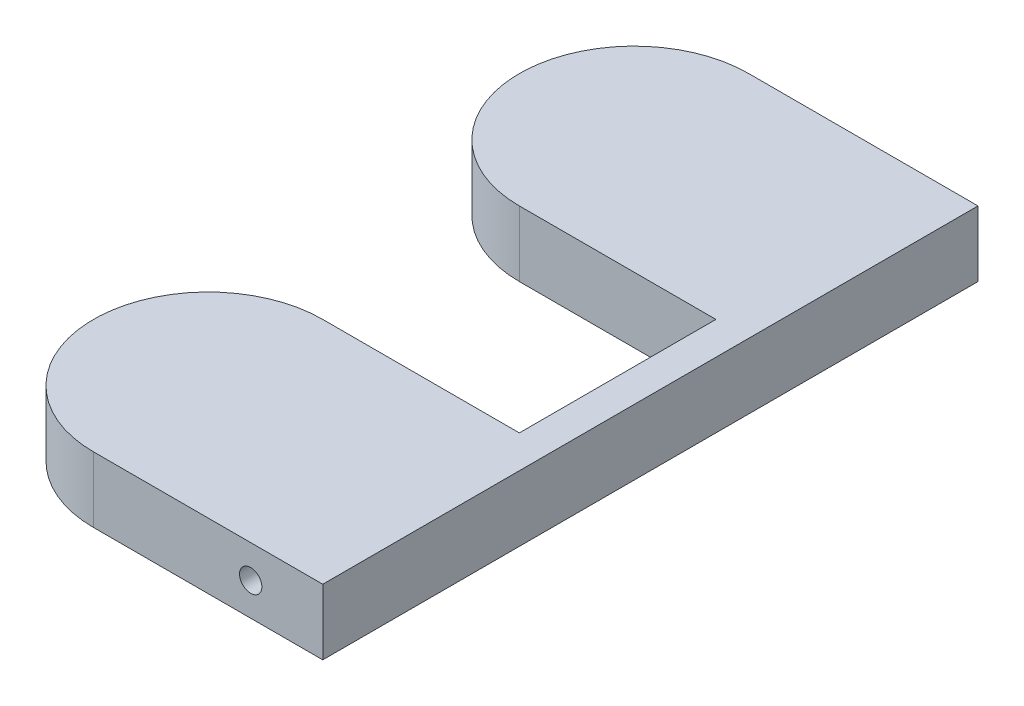
ISO-10303-21;
HEADER;
FILE_DESCRIPTION(('STEP AP214'),'2;1');
FILE_NAME('part.step','',(''),(''),'','','');
FILE_SCHEMA(('AUTOMOTIVE_DESIGN { 1 0 10303 214 1 1 1 1 }'));
ENDSEC;
DATA;
#1=APPLICATION_CONTEXT('core data for automotive mechanical design processes');
#2=APPLICATION_PROTOCOL_DEFINITION('international standard','automotive_design',2000,#1);
#3=PRODUCT_CONTEXT('',#1,'mechanical');
#4=PRODUCT('Part','Part','',(#3));
#5=PRODUCT_RELATED_PRODUCT_CATEGORY('part','',(#4));
#6=PRODUCT_DEFINITION_FORMATION('','',#4);
#7=PRODUCT_DEFINITION_CONTEXT('part definition',#1,'design');
#8=PRODUCT_DEFINITION('design','',#6,#7);
#9=PRODUCT_DEFINITION_SHAPE('','',#8);
#10=(LENGTH_UNIT() NAMED_UNIT(*) SI_UNIT(.MILLI.,.METRE.));
#11=(NAMED_UNIT(*) PLANE_ANGLE_UNIT() SI_UNIT($,.RADIAN.));
#12=(NAMED_UNIT(*) SI_UNIT($,.STERADIAN.) SOLID_ANGLE_UNIT());
#13=UNCERTAINTY_MEASURE_WITH_UNIT(LENGTH_MEASURE(1.E-05),#10,'distance_accuracy_value','');
#14=(GEOMETRIC_REPRESENTATION_CONTEXT(3) GLOBAL_UNCERTAINTY_ASSIGNED_CONTEXT((#13)) GLOBAL_UNIT_ASSIGNED_CONTEXT((#10,
#11,#12)) REPRESENTATION_CONTEXT('',''));
#15=CARTESIAN_POINT('',(0.,0.,0.));
#16=DIRECTION('',(0.,0.,1.));
#17=DIRECTION('',(1.,0.,0.));
#18=AXIS2_PLACEMENT_3D('',#15,#16,#17);
#19=CARTESIAN_POINT('',(-30.,0.,32.5));
#20=DIRECTION('',(0.,-1.,0.));
#21=DIRECTION('',(0.,0.,-1.));
#22=AXIS2_PLACEMENT_3D('',#19,#20,#21);
#23=PLANE('',#22);
#24=DIRECTION('',(1.,0.,0.));
#25=VECTOR('',#24,1.);
#26=CARTESIAN_POINT('',(5.00000000000001,0.,50.));
#27=LINE('',#26,#25);
#28=CARTESIAN_POINT('',(-30.,0.,50.));
#29=VERTEX_POINT('',#28);
#30=CARTESIAN_POINT('',(5.00000000000001,0.,50.));
#31=VERTEX_POINT('',#30);
#32=EDGE_CURVE('E241',#29,#31,#27,.T.);
#33=ORIENTED_EDGE('',*,*,#32,.F.);
#34=CARTESIAN_POINT('',(-30.,0.,32.5));
#35=DIRECTION('',(0.,1.,0.));
#36=DIRECTION('',(0.,0.,-1.));
#37=AXIS2_PLACEMENT_3D('',#34,#35,#36);
#38=CIRCLE('',#37,17.5);
#39=CARTESIAN_POINT('',(-30.,0.,15.));
#40=VERTEX_POINT('',#39);
#41=EDGE_CURVE('E247',#40,#29,#38,.T.);
#42=ORIENTED_EDGE('',*,*,#41,.F.);
#43=DIRECTION('',(-1.,0.,0.));
#44=VECTOR('',#43,1.);
#45=CARTESIAN_POINT('',(-30.,0.,15.));
#46=LINE('',#45,#44);
#47=CARTESIAN_POINT('',(0.,0.,15.));
#48=VERTEX_POINT('',#47);
#49=EDGE_CURVE('E287',#48,#40,#46,.T.);
#50=ORIENTED_EDGE('',*,*,#49,.F.);
#51=DIRECTION('',(0.,0.,1.));
#52=VECTOR('',#51,1.);
#53=CARTESIAN_POINT('',(0.,0.,15.));
#54=LINE('',#53,#52);
#55=CARTESIAN_POINT('',(0.,0.,-15.));
#56=VERTEX_POINT('',#55);
#57=EDGE_CURVE('E284',#56,#48,#54,.T.);
#58=ORIENTED_EDGE('',*,*,#57,.F.);
#59=DIRECTION('',(1.,0.,0.));
#60=VECTOR('',#59,1.);
#61=CARTESIAN_POINT('',(-30.,0.,-15.));
#62=LINE('',#61,#60);
#63=CARTESIAN_POINT('',(-30.,0.,-15.));
#64=VERTEX_POINT('',#63);
#65=EDGE_CURVE('E281',#64,#56,#62,.T.);
#66=ORIENTED_EDGE('',*,*,#65,.F.);
#67=CARTESIAN_POINT('',(-30.,0.,-32.5));
#68=DIRECTION('',(0.,1.,0.));
#69=DIRECTION('',(0.,0.,1.));
#70=AXIS2_PLACEMENT_3D('',#67,#68,#69);
#71=CIRCLE('',#70,17.5);
#72=CARTESIAN_POINT('',(-30.,0.,-50.));
#73=VERTEX_POINT('',#72);
#74=EDGE_CURVE('E278',#73,#64,#71,.T.);
#75=ORIENTED_EDGE('',*,*,#74,.F.);
#76=DIRECTION('',(-1.,0.,0.));
#77=VECTOR('',#76,1.);
#78=CARTESIAN_POINT('',(5.,0.,-50.));
#79=LINE('',#78,#77);
#80=CARTESIAN_POINT('',(5.,0.,-50.));
#81=VERTEX_POINT('',#80);
#82=EDGE_CURVE('E275',#81,#73,#79,.T.);
#83=ORIENTED_EDGE('',*,*,#82,.F.);
#84=DIRECTION('',(0.,0.,-1.));
#85=VECTOR('',#84,1.);
#86=CARTESIAN_POINT('',(5.,0.,-50.));
#87=LINE('',#86,#85);
#88=EDGE_CURVE('E272',#31,#81,#87,.T.);
#89=ORIENTED_EDGE('',*,*,#88,.F.);
#90=EDGE_LOOP('',(#33,#42,#50,#58,#66,#75,#83,#89));
#91=FACE_BOUND('',#90,.T.);
#92=DIRECTION('',(0.,0.,-1.));
#93=VECTOR('',#92,1.);
#94=CARTESIAN_POINT('',(-9.64999999999997,0.,43.));
#95=LINE('',#94,#93);
#96=CARTESIAN_POINT('',(-9.64999999999997,0.,43.));
#97=VERTEX_POINT('',#96);
#98=CARTESIAN_POINT('',(-9.64999999999997,0.,35.));
#99=VERTEX_POINT('',#98);
#100=EDGE_CURVE('E233',#97,#99,#95,.T.);
#101=ORIENTED_EDGE('',*,*,#100,.F.);
#102=DIRECTION('',(1.,0.,0.));
#103=VECTOR('',#102,1.);
#104=CARTESIAN_POINT('',(-9.64999999999997,0.,43.));
#105=LINE('',#104,#103);
#106=CARTESIAN_POINT('',(-2.34999999999997,0.,43.));
#107=VERTEX_POINT('',#106);
#108=EDGE_CURVE('E200',#97,#107,#105,.T.);
#109=ORIENTED_EDGE('',*,*,#108,.T.);
#110=DIRECTION('',(0.,0.,-1.));
#111=VECTOR('',#110,1.);
#112=CARTESIAN_POINT('',(-2.34999999999997,0.,43.));
#113=LINE('',#112,#111);
#114=CARTESIAN_POINT('',(-2.34999999999997,0.,35.));
#115=VERTEX_POINT('',#114);
#116=EDGE_CURVE('E229',#107,#115,#113,.T.);
#117=ORIENTED_EDGE('',*,*,#116,.T.);
#118=DIRECTION('',(1.,0.,0.));
#119=VECTOR('',#118,1.);
#120=CARTESIAN_POINT('',(-9.64999999999997,0.,35.));
#121=LINE('',#120,#119);
#122=EDGE_CURVE('E214',#99,#115,#121,.T.);
#123=ORIENTED_EDGE('',*,*,#122,.F.);
#124=EDGE_LOOP('',(#101,#109,#117,#123));
#125=FACE_BOUND('',#124,.T.);
#126=DIRECTION('',(0.,0.,1.));
#127=VECTOR('',#126,1.);
#128=CARTESIAN_POINT('',(-2.34999999999997,0.,-43.));
#129=LINE('',#128,#127);
#130=CARTESIAN_POINT('',(-2.34999999999997,0.,-43.));
#131=VERTEX_POINT('',#130);
#132=CARTESIAN_POINT('',(-2.34999999999997,0.,-35.));
#133=VERTEX_POINT('',#132);
#134=EDGE_CURVE('E57',#131,#133,#129,.T.);
#135=ORIENTED_EDGE('',*,*,#134,.F.);
#136=DIRECTION('',(-1.,0.,0.));
#137=VECTOR('',#136,1.);
#138=CARTESIAN_POINT('',(-9.64999999999997,0.,-43.));
#139=LINE('',#138,#137);
#140=CARTESIAN_POINT('',(-9.64999999999997,0.,-43.));
#141=VERTEX_POINT('',#140);
#142=EDGE_CURVE('E448',#131,#141,#139,.T.);
#143=ORIENTED_EDGE('',*,*,#142,.T.);
#144=DIRECTION('',(0.,0.,1.));
#145=VECTOR('',#144,1.);
#146=CARTESIAN_POINT('',(-9.64999999999997,0.,-43.));
#147=LINE('',#146,#145);
#148=CARTESIAN_POINT('',(-9.64999999999997,0.,-35.));
#149=VERTEX_POINT('',#148);
#150=EDGE_CURVE('E177',#141,#149,#147,.T.);
#151=ORIENTED_EDGE('',*,*,#150,.T.);
#152=DIRECTION('',(-1.,0.,0.));
#153=VECTOR('',#152,1.);
#154=CARTESIAN_POINT('',(-9.64999999999997,0.,-35.));
#155=LINE('',#154,#153);
#156=EDGE_CURVE('E179',#133,#149,#155,.T.);
#157=ORIENTED_EDGE('',*,*,#156,.F.);
#158=EDGE_LOOP('',(#135,#143,#151,#157));
#159=FACE_BOUND('',#158,.T.);
#160=ADVANCED_FACE('F39',(#91,#125,#159),#23,.T.);
#161=CARTESIAN_POINT('',(-5.99999999999999,5.,-35.));
#162=DIRECTION('',(0.,0.,-1.));
#163=DIRECTION('',(-1.,0.,0.));
#164=AXIS2_PLACEMENT_3D('',#161,#162,#163);
#165=CYLINDRICAL_SURFACE('',#164,1.705);
#166=CARTESIAN_POINT('',(-5.99999999999999,5.,-50.));
#167=DIRECTION('',(0.,0.,-1.));
#168=DIRECTION('',(-1.,0.,0.));
#169=AXIS2_PLACEMENT_3D('',#166,#167,#168);
#170=CIRCLE('',#169,1.705);
#171=CARTESIAN_POINT('',(-7.70499999999999,5.,-50.));
#172=VERTEX_POINT('',#171);
#173=EDGE_CURVE('E189',#172,#172,#170,.T.);
#174=ORIENTED_EDGE('',*,*,#173,.T.);
#175=EDGE_LOOP('',(#174));
#176=FACE_BOUND('',#175,.T.);
#177=CARTESIAN_POINT('',(-5.99999999999999,5.,-43.));
#178=DIRECTION('',(0.,0.,1.));
#179=DIRECTION('',(1.,0.,0.));
#180=AXIS2_PLACEMENT_3D('',#177,#178,#179);
#181=CIRCLE('',#180,1.705);
#182=CARTESIAN_POINT('',(-4.29499999999999,5.,-43.));
#183=VERTEX_POINT('',#182);
#184=EDGE_CURVE('E43',#183,#183,#181,.F.);
#185=ORIENTED_EDGE('',*,*,#184,.F.);
#186=EDGE_LOOP('',(#185));
#187=FACE_BOUND('',#186,.T.);
#188=ADVANCED_FACE('F325',(#176,#187),#165,.F.);
#189=CARTESIAN_POINT('',(-5.99999999999999,5.,35.));
#190=DIRECTION('',(0.,0.,1.));
#191=DIRECTION('',(1.,0.,0.));
#192=AXIS2_PLACEMENT_3D('',#189,#190,#191);
#193=CYLINDRICAL_SURFACE('',#192,1.705);
#194=CARTESIAN_POINT('',(-5.99999999999999,5.,50.));
#195=DIRECTION('',(0.,0.,1.));
#196=DIRECTION('',(1.,0.,0.));
#197=AXIS2_PLACEMENT_3D('',#194,#195,#196);
#198=CIRCLE('',#197,1.705);
#199=CARTESIAN_POINT('',(-4.29499999999999,5.,50.));
#200=VERTEX_POINT('',#199);
#201=EDGE_CURVE('E237',#200,#200,#198,.T.);
#202=ORIENTED_EDGE('',*,*,#201,.T.);
#203=EDGE_LOOP('',(#202));
#204=FACE_BOUND('',#203,.T.);
#205=CARTESIAN_POINT('',(-5.99999999999999,5.,43.));
#206=DIRECTION('',(0.,0.,-1.));
#207=DIRECTION('',(-1.,0.,0.));
#208=AXIS2_PLACEMENT_3D('',#205,#206,#207);
#209=CIRCLE('',#208,1.705);
#210=CARTESIAN_POINT('',(-7.70499999999999,5.,43.));
#211=VERTEX_POINT('',#210);
#212=EDGE_CURVE('E236',#211,#211,#209,.F.);
#213=ORIENTED_EDGE('',*,*,#212,.F.);
#214=EDGE_LOOP('',(#213));
#215=FACE_BOUND('',#214,.T.);
#216=ADVANCED_FACE('F323',(#204,#215),#193,.F.);
#217=CARTESIAN_POINT('',(5.00000000000001,10.,50.));
#218=DIRECTION('',(0.,0.,-1.));
#219=DIRECTION('',(-1.,0.,0.));
#220=AXIS2_PLACEMENT_3D('',#217,#218,#219);
#221=PLANE('',#220);
#222=ORIENTED_EDGE('',*,*,#201,.F.);
#223=EDGE_LOOP('',(#222));
#224=FACE_BOUND('',#223,.T.);
#225=ORIENTED_EDGE('',*,*,#32,.T.);
#226=DIRECTION('',(0.,-1.,0.));
#227=VECTOR('',#226,1.);
#228=CARTESIAN_POINT('',(5.00000000000001,10.,50.));
#229=LINE('',#228,#227);
#230=CARTESIAN_POINT('',(5.00000000000001,10.,50.));
#231=VERTEX_POINT('',#230);
#232=EDGE_CURVE('E11',#231,#31,#229,.T.);
#233=ORIENTED_EDGE('',*,*,#232,.F.);
#234=DIRECTION('',(1.,0.,0.));
#235=VECTOR('',#234,1.);
#236=CARTESIAN_POINT('',(5.00000000000001,10.,50.));
#237=LINE('',#236,#235);
#238=CARTESIAN_POINT('',(-30.,10.,50.));
#239=VERTEX_POINT('',#238);
#240=EDGE_CURVE('E242',#239,#231,#237,.T.);
#241=ORIENTED_EDGE('',*,*,#240,.F.);
#242=DIRECTION('',(0.,-1.,0.));
#243=VECTOR('',#242,1.);
#244=CARTESIAN_POINT('',(-30.,10.,50.));
#245=LINE('',#244,#243);
#246=EDGE_CURVE('E268',#239,#29,#245,.T.);
#247=ORIENTED_EDGE('',*,*,#246,.T.);
#248=EDGE_LOOP('',(#225,#233,#241,#247));
#249=FACE_BOUND('',#248,.T.);
#250=ADVANCED_FACE('F41',(#224,#249),#221,.F.);
#251=CARTESIAN_POINT('',(5.,10.,-50.));
#252=DIRECTION('',(-1.,0.,0.));
#253=DIRECTION('',(0.,0.,1.));
#254=AXIS2_PLACEMENT_3D('',#251,#252,#253);
#255=PLANE('',#254);
#256=ORIENTED_EDGE('',*,*,#88,.T.);
#257=DIRECTION('',(0.,-1.,0.));
#258=VECTOR('',#257,1.);
#259=CARTESIAN_POINT('',(5.,10.,-50.));
#260=LINE('',#259,#258);
#261=CARTESIAN_POINT('',(5.,10.,-50.));
#262=VERTEX_POINT('',#261);
#263=EDGE_CURVE('E49',#262,#81,#260,.T.);
#264=ORIENTED_EDGE('',*,*,#263,.F.);
#265=DIRECTION('',(0.,0.,-1.));
#266=VECTOR('',#265,1.);
#267=CARTESIAN_POINT('',(5.,10.,-50.));
#268=LINE('',#267,#266);
#269=EDGE_CURVE('E246',#231,#262,#268,.T.);
#270=ORIENTED_EDGE('',*,*,#269,.F.);
#271=ORIENTED_EDGE('',*,*,#232,.T.);
#272=EDGE_LOOP('',(#256,#264,#270,#271));
#273=FACE_BOUND('',#272,.T.);
#274=ADVANCED_FACE('F332',(#273),#255,.F.);
#275=CARTESIAN_POINT('',(5.,10.,-50.));
#276=DIRECTION('',(0.,0.,1.));
#277=DIRECTION('',(1.,0.,0.));
#278=AXIS2_PLACEMENT_3D('',#275,#276,#277);
#279=PLANE('',#278);
#280=ORIENTED_EDGE('',*,*,#173,.F.);
#281=EDGE_LOOP('',(#280));
#282=FACE_BOUND('',#281,.T.);
#283=ORIENTED_EDGE('',*,*,#82,.T.);
#284=DIRECTION('',(0.,-1.,0.));
#285=VECTOR('',#284,1.);
#286=CARTESIAN_POINT('',(-30.,10.,-50.));
#287=LINE('',#286,#285);
#288=CARTESIAN_POINT('',(-30.,10.,-50.));
#289=VERTEX_POINT('',#288);
#290=EDGE_CURVE('E311',#289,#73,#287,.T.);
#291=ORIENTED_EDGE('',*,*,#290,.F.);
#292=DIRECTION('',(-1.,0.,0.));
#293=VECTOR('',#292,1.);
#294=CARTESIAN_POINT('',(5.,10.,-50.));
#295=LINE('',#294,#293);
#296=EDGE_CURVE('E250',#262,#289,#295,.T.);
#297=ORIENTED_EDGE('',*,*,#296,.F.);
#298=ORIENTED_EDGE('',*,*,#263,.T.);
#299=EDGE_LOOP('',(#283,#291,#297,#298));
#300=FACE_BOUND('',#299,.T.);
#301=ADVANCED_FACE('F366',(#282,#300),#279,.F.);
#302=CARTESIAN_POINT('',(-30.,10.,-32.5));
#303=DIRECTION('',(0.,-1.,0.));
#304=DIRECTION('',(0.,0.,-1.));
#305=AXIS2_PLACEMENT_3D('',#302,#303,#304);
#306=CYLINDRICAL_SURFACE('',#305,17.5);
#307=ORIENTED_EDGE('',*,*,#74,.T.);
#308=DIRECTION('',(0.,-1.,0.));
#309=VECTOR('',#308,1.);
#310=CARTESIAN_POINT('',(-30.,10.,-15.));
#311=LINE('',#310,#309);
#312=CARTESIAN_POINT('',(-30.,10.,-15.));
#313=VERTEX_POINT('',#312);
#314=EDGE_CURVE('E307',#313,#64,#311,.T.);
#315=ORIENTED_EDGE('',*,*,#314,.F.);
#316=CARTESIAN_POINT('',(-30.,10.,-32.5));
#317=DIRECTION('',(0.,1.,0.));
#318=DIRECTION('',(0.,0.,1.));
#319=AXIS2_PLACEMENT_3D('',#316,#317,#318);
#320=CIRCLE('',#319,17.5);
#321=EDGE_CURVE('E253',#289,#313,#320,.T.);
#322=ORIENTED_EDGE('',*,*,#321,.F.);
#323=ORIENTED_EDGE('',*,*,#290,.T.);
#324=EDGE_LOOP('',(#307,#315,#322,#323));
#325=FACE_BOUND('',#324,.T.);
#326=ADVANCED_FACE('F362',(#325),#306,.T.);
#327=CARTESIAN_POINT('',(-30.,10.,-15.));
#328=DIRECTION('',(0.,0.,-1.));
#329=DIRECTION('',(-1.,0.,0.));
#330=AXIS2_PLACEMENT_3D('',#327,#328,#329);
#331=PLANE('',#330);
#332=ORIENTED_EDGE('',*,*,#65,.T.);
#333=DIRECTION('',(0.,-1.,0.));
#334=VECTOR('',#333,1.);
#335=CARTESIAN_POINT('',(0.,10.,-15.));
#336=LINE('',#335,#334);
#337=CARTESIAN_POINT('',(0.,10.,-15.));
#338=VERTEX_POINT('',#337);
#339=EDGE_CURVE('E303',#338,#56,#336,.T.);
#340=ORIENTED_EDGE('',*,*,#339,.F.);
#341=DIRECTION('',(1.,0.,0.));
#342=VECTOR('',#341,1.);
#343=CARTESIAN_POINT('',(-30.,10.,-15.));
#344=LINE('',#343,#342);
#345=EDGE_CURVE('E256',#313,#338,#344,.T.);
#346=ORIENTED_EDGE('',*,*,#345,.F.);
#347=ORIENTED_EDGE('',*,*,#314,.T.);
#348=EDGE_LOOP('',(#332,#340,#346,#347));
#349=FACE_BOUND('',#348,.T.);
#350=ADVANCED_FACE('F358',(#349),#331,.F.);
#351=CARTESIAN_POINT('',(0.,10.,15.));
#352=DIRECTION('',(1.,0.,0.));
#353=DIRECTION('',(0.,0.,-1.));
#354=AXIS2_PLACEMENT_3D('',#351,#352,#353);
#355=PLANE('',#354);
#356=ORIENTED_EDGE('',*,*,#57,.T.);
#357=DIRECTION('',(0.,-1.,0.));
#358=VECTOR('',#357,1.);
#359=CARTESIAN_POINT('',(0.,10.,15.));
#360=LINE('',#359,#358);
#361=CARTESIAN_POINT('',(0.,10.,15.));
#362=VERTEX_POINT('',#361);
#363=EDGE_CURVE('E299',#362,#48,#360,.T.);
#364=ORIENTED_EDGE('',*,*,#363,.F.);
#365=DIRECTION('',(0.,0.,1.));
#366=VECTOR('',#365,1.);
#367=CARTESIAN_POINT('',(0.,10.,15.));
#368=LINE('',#367,#366);
#369=EDGE_CURVE('E259',#338,#362,#368,.T.);
#370=ORIENTED_EDGE('',*,*,#369,.F.);
#371=ORIENTED_EDGE('',*,*,#339,.T.);
#372=EDGE_LOOP('',(#356,#364,#370,#371));
#373=FACE_BOUND('',#372,.T.);
#374=ADVANCED_FACE('F354',(#373),#355,.F.);
#375=CARTESIAN_POINT('',(-30.,10.,15.));
#376=DIRECTION('',(0.,0.,1.));
#377=DIRECTION('',(1.,0.,0.));
#378=AXIS2_PLACEMENT_3D('',#375,#376,#377);
#379=PLANE('',#378);
#380=ORIENTED_EDGE('',*,*,#49,.T.);
#381=DIRECTION('',(0.,-1.,0.));
#382=VECTOR('',#381,1.);
#383=CARTESIAN_POINT('',(-30.,10.,15.));
#384=LINE('',#383,#382);
#385=CARTESIAN_POINT('',(-30.,10.,15.));
#386=VERTEX_POINT('',#385);
#387=EDGE_CURVE('E295',#386,#40,#384,.T.);
#388=ORIENTED_EDGE('',*,*,#387,.F.);
#389=DIRECTION('',(-1.,0.,0.));
#390=VECTOR('',#389,1.);
#391=CARTESIAN_POINT('',(-30.,10.,15.));
#392=LINE('',#391,#390);
#393=EDGE_CURVE('E262',#362,#386,#392,.T.);
#394=ORIENTED_EDGE('',*,*,#393,.F.);
#395=ORIENTED_EDGE('',*,*,#363,.T.);
#396=EDGE_LOOP('',(#380,#388,#394,#395));
#397=FACE_BOUND('',#396,.T.);
#398=ADVANCED_FACE('F350',(#397),#379,.F.);
#399=CARTESIAN_POINT('',(-30.,10.,32.5));
#400=DIRECTION('',(0.,-1.,0.));
#401=DIRECTION('',(0.,0.,-1.));
#402=AXIS2_PLACEMENT_3D('',#399,#400,#401);
#403=CYLINDRICAL_SURFACE('',#402,17.5);
#404=ORIENTED_EDGE('',*,*,#41,.T.);
#405=ORIENTED_EDGE('',*,*,#246,.F.);
#406=CARTESIAN_POINT('',(-30.,10.,32.5));
#407=DIRECTION('',(0.,1.,0.));
#408=DIRECTION('',(0.,0.,-1.));
#409=AXIS2_PLACEMENT_3D('',#406,#407,#408);
#410=CIRCLE('',#409,17.5);
#411=EDGE_CURVE('E265',#386,#239,#410,.T.);
#412=ORIENTED_EDGE('',*,*,#411,.F.);
#413=ORIENTED_EDGE('',*,*,#387,.T.);
#414=EDGE_LOOP('',(#404,#405,#412,#413));
#415=FACE_BOUND('',#414,.T.);
#416=ADVANCED_FACE('F347',(#415),#403,.T.);
#417=CARTESIAN_POINT('',(-30.,10.,32.5));
#418=DIRECTION('',(0.,-1.,0.));
#419=DIRECTION('',(0.,0.,-1.));
#420=AXIS2_PLACEMENT_3D('',#417,#418,#419);
#421=PLANE('',#420);
#422=ORIENTED_EDGE('',*,*,#240,.T.);
#423=ORIENTED_EDGE('',*,*,#269,.T.);
#424=ORIENTED_EDGE('',*,*,#296,.T.);
#425=ORIENTED_EDGE('',*,*,#321,.T.);
#426=ORIENTED_EDGE('',*,*,#345,.T.);
#427=ORIENTED_EDGE('',*,*,#369,.T.);
#428=ORIENTED_EDGE('',*,*,#393,.T.);
#429=ORIENTED_EDGE('',*,*,#411,.T.);
#430=EDGE_LOOP('',(#422,#423,#424,#425,#426,#427,#428,#429));
#431=FACE_BOUND('',#430,.T.);
#432=ADVANCED_FACE('F346',(#431),#421,.F.);
#433=CARTESIAN_POINT('',(0.,0.,43.));
#434=DIRECTION('',(0.,0.,-1.));
#435=DIRECTION('',(-1.,0.,0.));
#436=AXIS2_PLACEMENT_3D('',#433,#434,#435);
#437=PLANE('',#436);
#438=DIRECTION('',(0.,-1.,0.));
#439=VECTOR('',#438,1.);
#440=CARTESIAN_POINT('',(-9.64999999999997,0.,43.));
#441=LINE('',#440,#439);
#442=CARTESIAN_POINT('',(-9.64999999999997,8.65,43.));
#443=VERTEX_POINT('',#442);
#444=EDGE_CURVE('E196',#443,#97,#441,.T.);
#445=ORIENTED_EDGE('',*,*,#444,.F.);
#446=DIRECTION('',(-1.,0.,0.));
#447=VECTOR('',#446,1.);
#448=CARTESIAN_POINT('',(-9.64999999999997,8.65,43.));
#449=LINE('',#448,#447);
#450=CARTESIAN_POINT('',(-2.34999999999997,8.65,43.));
#451=VERTEX_POINT('',#450);
#452=EDGE_CURVE('E208',#451,#443,#449,.T.);
#453=ORIENTED_EDGE('',*,*,#452,.F.);
#454=DIRECTION('',(0.,1.,0.));
#455=VECTOR('',#454,1.);
#456=CARTESIAN_POINT('',(-2.34999999999997,0.,43.));
#457=LINE('',#456,#455);
#458=EDGE_CURVE('E205',#107,#451,#457,.T.);
#459=ORIENTED_EDGE('',*,*,#458,.F.);
#460=ORIENTED_EDGE('',*,*,#108,.F.);
#461=EDGE_LOOP('',(#445,#453,#459,#460));
#462=FACE_BOUND('',#461,.T.);
#463=ORIENTED_EDGE('',*,*,#212,.T.);
#464=EDGE_LOOP('',(#463));
#465=FACE_BOUND('',#464,.T.);
#466=ADVANCED_FACE('F321',(#462,#465),#437,.T.);
#467=CARTESIAN_POINT('',(-9.64999999999997,0.,43.));
#468=DIRECTION('',(1.,0.,0.));
#469=DIRECTION('',(0.,0.,-1.));
#470=AXIS2_PLACEMENT_3D('',#467,#468,#469);
#471=PLANE('',#470);
#472=DIRECTION('',(0.,-1.,0.));
#473=VECTOR('',#472,1.);
#474=CARTESIAN_POINT('',(-9.64999999999997,0.,35.));
#475=LINE('',#474,#473);
#476=CARTESIAN_POINT('',(-9.64999999999997,8.65,35.));
#477=VERTEX_POINT('',#476);
#478=EDGE_CURVE('E65',#477,#99,#475,.T.);
#479=ORIENTED_EDGE('',*,*,#478,.F.);
#480=DIRECTION('',(0.,0.,-1.));
#481=VECTOR('',#480,1.);
#482=CARTESIAN_POINT('',(-9.64999999999997,8.65,43.));
#483=LINE('',#482,#481);
#484=EDGE_CURVE('E211',#443,#477,#483,.T.);
#485=ORIENTED_EDGE('',*,*,#484,.F.);
#486=ORIENTED_EDGE('',*,*,#444,.T.);
#487=ORIENTED_EDGE('',*,*,#100,.T.);
#488=EDGE_LOOP('',(#479,#485,#486,#487));
#489=FACE_BOUND('',#488,.T.);
#490=ADVANCED_FACE('F402',(#489),#471,.T.);
#491=CARTESIAN_POINT('',(-2.34999999999997,0.,43.));
#492=DIRECTION('',(-1.,0.,0.));
#493=DIRECTION('',(0.,0.,1.));
#494=AXIS2_PLACEMENT_3D('',#491,#492,#493);
#495=PLANE('',#494);
#496=DIRECTION('',(0.,1.,0.));
#497=VECTOR('',#496,1.);
#498=CARTESIAN_POINT('',(-2.34999999999997,0.,35.));
#499=LINE('',#498,#497);
#500=CARTESIAN_POINT('',(-2.34999999999997,8.65,35.));
#501=VERTEX_POINT('',#500);
#502=EDGE_CURVE('E217',#115,#501,#499,.T.);
#503=ORIENTED_EDGE('',*,*,#502,.F.);
#504=ORIENTED_EDGE('',*,*,#116,.F.);
#505=ORIENTED_EDGE('',*,*,#458,.T.);
#506=DIRECTION('',(0.,0.,-1.));
#507=VECTOR('',#506,1.);
#508=CARTESIAN_POINT('',(-2.34999999999997,8.65,43.));
#509=LINE('',#508,#507);
#510=EDGE_CURVE('E225',#451,#501,#509,.T.);
#511=ORIENTED_EDGE('',*,*,#510,.T.);
#512=EDGE_LOOP('',(#503,#504,#505,#511));
#513=FACE_BOUND('',#512,.T.);
#514=ADVANCED_FACE('F408',(#513),#495,.T.);
#515=CARTESIAN_POINT('',(-9.64999999999997,8.65,43.));
#516=DIRECTION('',(0.,-1.,0.));
#517=DIRECTION('',(0.,0.,-1.));
#518=AXIS2_PLACEMENT_3D('',#515,#516,#517);
#519=PLANE('',#518);
#520=DIRECTION('',(-1.,0.,0.));
#521=VECTOR('',#520,1.);
#522=CARTESIAN_POINT('',(-9.64999999999997,8.65,35.));
#523=LINE('',#522,#521);
#524=EDGE_CURVE('E201',#501,#477,#523,.T.);
#525=ORIENTED_EDGE('',*,*,#524,.F.);
#526=ORIENTED_EDGE('',*,*,#510,.F.);
#527=ORIENTED_EDGE('',*,*,#452,.T.);
#528=ORIENTED_EDGE('',*,*,#484,.T.);
#529=EDGE_LOOP('',(#525,#526,#527,#528));
#530=FACE_BOUND('',#529,.T.);
#531=ADVANCED_FACE('F414',(#530),#519,.T.);
#532=CARTESIAN_POINT('',(-5.99999999999999,5.,35.));
#533=DIRECTION('',(0.,0.,1.));
#534=DIRECTION('',(1.,0.,0.));
#535=AXIS2_PLACEMENT_3D('',#532,#533,#534);
#536=PLANE('',#535);
#537=ORIENTED_EDGE('',*,*,#478,.T.);
#538=ORIENTED_EDGE('',*,*,#122,.T.);
#539=ORIENTED_EDGE('',*,*,#502,.T.);
#540=ORIENTED_EDGE('',*,*,#524,.T.);
#541=EDGE_LOOP('',(#537,#538,#539,#540));
#542=FACE_BOUND('',#541,.T.);
#543=ADVANCED_FACE('F417',(#542),#536,.T.);
#544=CARTESIAN_POINT('',(0.,0.,-43.));
#545=DIRECTION('',(0.,0.,1.));
#546=DIRECTION('',(1.,0.,0.));
#547=AXIS2_PLACEMENT_3D('',#544,#545,#546);
#548=PLANE('',#547);
#549=DIRECTION('',(0.,1.,0.));
#550=VECTOR('',#549,1.);
#551=CARTESIAN_POINT('',(-9.64999999999997,8.65,-43.));
#552=LINE('',#551,#550);
#553=CARTESIAN_POINT('',(-9.64999999999997,8.65,-43.));
#554=VERTEX_POINT('',#553);
#555=EDGE_CURVE('E161',#141,#554,#552,.T.);
#556=ORIENTED_EDGE('',*,*,#555,.F.);
#557=ORIENTED_EDGE('',*,*,#142,.F.);
#558=DIRECTION('',(0.,-1.,0.));
#559=VECTOR('',#558,1.);
#560=CARTESIAN_POINT('',(-2.34999999999997,8.65,-43.));
#561=LINE('',#560,#559);
#562=CARTESIAN_POINT('',(-2.34999999999997,8.65,-43.));
#563=VERTEX_POINT('',#562);
#564=EDGE_CURVE('E163',#563,#131,#561,.T.);
#565=ORIENTED_EDGE('',*,*,#564,.F.);
#566=DIRECTION('',(1.,0.,0.));
#567=VECTOR('',#566,1.);
#568=CARTESIAN_POINT('',(-9.64999999999997,8.65,-43.));
#569=LINE('',#568,#567);
#570=EDGE_CURVE('E156',#554,#563,#569,.T.);
#571=ORIENTED_EDGE('',*,*,#570,.F.);
#572=EDGE_LOOP('',(#556,#557,#565,#571));
#573=FACE_BOUND('',#572,.T.);
#574=ORIENTED_EDGE('',*,*,#184,.T.);
#575=EDGE_LOOP('',(#574));
#576=FACE_BOUND('',#575,.T.);
#577=ADVANCED_FACE('F158',(#573,#576),#548,.T.);
#578=CARTESIAN_POINT('',(-9.64999999999997,8.65,-43.));
#579=DIRECTION('',(1.,0.,0.));
#580=DIRECTION('',(0.,0.,-1.));
#581=AXIS2_PLACEMENT_3D('',#578,#579,#580);
#582=PLANE('',#581);
#583=DIRECTION('',(0.,1.,0.));
#584=VECTOR('',#583,1.);
#585=CARTESIAN_POINT('',(-9.64999999999997,8.65,-35.));
#586=LINE('',#585,#584);
#587=CARTESIAN_POINT('',(-9.64999999999997,8.65,-35.));
#588=VERTEX_POINT('',#587);
#589=EDGE_CURVE('E440',#149,#588,#586,.T.);
#590=ORIENTED_EDGE('',*,*,#589,.F.);
#591=ORIENTED_EDGE('',*,*,#150,.F.);
#592=ORIENTED_EDGE('',*,*,#555,.T.);
#593=DIRECTION('',(0.,0.,1.));
#594=VECTOR('',#593,1.);
#595=CARTESIAN_POINT('',(-9.64999999999997,8.65,-43.));
#596=LINE('',#595,#594);
#597=EDGE_CURVE('E174',#554,#588,#596,.T.);
#598=ORIENTED_EDGE('',*,*,#597,.T.);
#599=EDGE_LOOP('',(#590,#591,#592,#598));
#600=FACE_BOUND('',#599,.T.);
#601=ADVANCED_FACE('F173',(#600),#582,.T.);
#602=CARTESIAN_POINT('',(-9.64999999999997,8.65,-43.));
#603=DIRECTION('',(0.,-1.,0.));
#604=DIRECTION('',(1.,0.,0.));
#605=AXIS2_PLACEMENT_3D('',#602,#603,#604);
#606=PLANE('',#605);
#607=DIRECTION('',(1.,0.,0.));
#608=VECTOR('',#607,1.);
#609=CARTESIAN_POINT('',(-9.64999999999997,8.65,-35.));
#610=LINE('',#609,#608);
#611=CARTESIAN_POINT('',(-2.34999999999997,8.65,-35.));
#612=VERTEX_POINT('',#611);
#613=EDGE_CURVE('E182',#588,#612,#610,.T.);
#614=ORIENTED_EDGE('',*,*,#613,.F.);
#615=ORIENTED_EDGE('',*,*,#597,.F.);
#616=ORIENTED_EDGE('',*,*,#570,.T.);
#617=DIRECTION('',(0.,0.,1.));
#618=VECTOR('',#617,1.);
#619=CARTESIAN_POINT('',(-2.34999999999997,8.65,-43.));
#620=LINE('',#619,#618);
#621=EDGE_CURVE('E184',#563,#612,#620,.T.);
#622=ORIENTED_EDGE('',*,*,#621,.T.);
#623=EDGE_LOOP('',(#614,#615,#616,#622));
#624=FACE_BOUND('',#623,.T.);
#625=ADVANCED_FACE('F181',(#624),#606,.T.);
#626=CARTESIAN_POINT('',(-2.34999999999997,8.65,-43.));
#627=DIRECTION('',(-1.,0.,0.));
#628=DIRECTION('',(0.,0.,1.));
#629=AXIS2_PLACEMENT_3D('',#626,#627,#628);
#630=PLANE('',#629);
#631=DIRECTION('',(0.,-1.,0.));
#632=VECTOR('',#631,1.);
#633=CARTESIAN_POINT('',(-2.34999999999997,8.65,-35.));
#634=LINE('',#633,#632);
#635=EDGE_CURVE('E445',#612,#133,#634,.T.);
#636=ORIENTED_EDGE('',*,*,#635,.F.);
#637=ORIENTED_EDGE('',*,*,#621,.F.);
#638=ORIENTED_EDGE('',*,*,#564,.T.);
#639=ORIENTED_EDGE('',*,*,#134,.T.);
#640=EDGE_LOOP('',(#636,#637,#638,#639));
#641=FACE_BOUND('',#640,.T.);
#642=ADVANCED_FACE('F431',(#641),#630,.T.);
#643=CARTESIAN_POINT('',(-5.99999999999999,5.,-35.));
#644=DIRECTION('',(0.,0.,-1.));
#645=DIRECTION('',(-1.,0.,0.));
#646=AXIS2_PLACEMENT_3D('',#643,#644,#645);
#647=PLANE('',#646);
#648=ORIENTED_EDGE('',*,*,#589,.T.);
#649=ORIENTED_EDGE('',*,*,#613,.T.);
#650=ORIENTED_EDGE('',*,*,#635,.T.);
#651=ORIENTED_EDGE('',*,*,#156,.T.);
#652=EDGE_LOOP('',(#648,#649,#650,#651));
#653=FACE_BOUND('',#652,.T.);
#654=ADVANCED_FACE('F434',(#653),#647,.T.);
#655=CLOSED_SHELL('',(#160,#188,#216,#250,#274,#301,#326,#350,#374,#398,#416,#432,#466,#490,
#514,#531,#543,#577,#601,#625,#642,#654));
#656=MANIFOLD_SOLID_BREP('B2',#655);
#657=ADVANCED_BREP_SHAPE_REPRESENTATION('',(#18,#656),#14);
#658=SHAPE_DEFINITION_REPRESENTATION(#9,#657);
ENDSEC;
END-ISO-10303-21;
